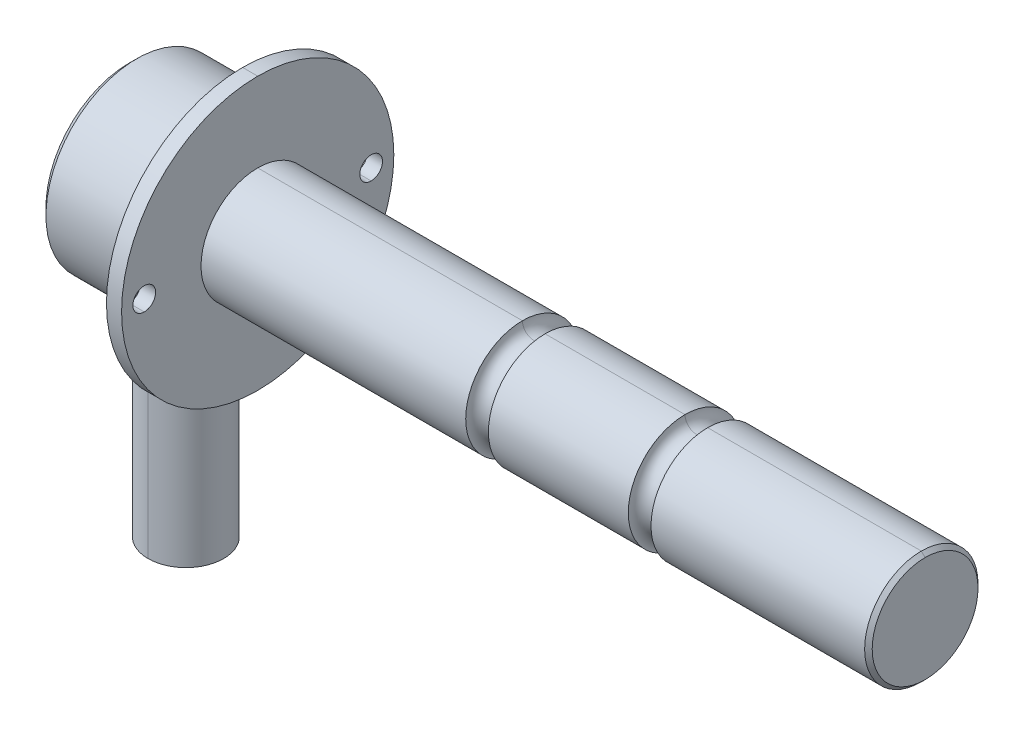
ISO-10303-21;
HEADER;
FILE_DESCRIPTION(('STEP AP214'),'2;1');
FILE_NAME('part.step','',(''),(''),'','','');
FILE_SCHEMA(('AUTOMOTIVE_DESIGN { 1 0 10303 214 1 1 1 1 }'));
ENDSEC;
DATA;
#1=APPLICATION_CONTEXT('core data for automotive mechanical design processes');
#2=APPLICATION_PROTOCOL_DEFINITION('international standard','automotive_design',2000,#1);
#3=PRODUCT_CONTEXT('',#1,'mechanical');
#4=PRODUCT('Part','Part','',(#3));
#5=PRODUCT_RELATED_PRODUCT_CATEGORY('part','',(#4));
#6=PRODUCT_DEFINITION_FORMATION('','',#4);
#7=PRODUCT_DEFINITION_CONTEXT('part definition',#1,'design');
#8=PRODUCT_DEFINITION('design','',#6,#7);
#9=PRODUCT_DEFINITION_SHAPE('','',#8);
#10=(LENGTH_UNIT() NAMED_UNIT(*) SI_UNIT(.MILLI.,.METRE.));
#11=(NAMED_UNIT(*) PLANE_ANGLE_UNIT() SI_UNIT($,.RADIAN.));
#12=(NAMED_UNIT(*) SI_UNIT($,.STERADIAN.) SOLID_ANGLE_UNIT());
#13=UNCERTAINTY_MEASURE_WITH_UNIT(LENGTH_MEASURE(1.E-05),#10,'distance_accuracy_value','');
#14=(GEOMETRIC_REPRESENTATION_CONTEXT(3) GLOBAL_UNCERTAINTY_ASSIGNED_CONTEXT((#13)) GLOBAL_UNIT_ASSIGNED_CONTEXT((#10,
#11,#12)) REPRESENTATION_CONTEXT('',''));
#15=CARTESIAN_POINT('',(0.,0.,0.));
#16=DIRECTION('',(0.,0.,1.));
#17=DIRECTION('',(1.,0.,0.));
#18=AXIS2_PLACEMENT_3D('',#15,#16,#17);
#19=CARTESIAN_POINT('',(0.,0.,0.));
#20=DIRECTION('',(1.,0.,0.));
#21=DIRECTION('',(0.,-1.,0.));
#22=AXIS2_PLACEMENT_3D('',#19,#20,#21);
#23=PLANE('',#22);
#24=CARTESIAN_POINT('',(0.,0.,30.));
#25=DIRECTION('',(1.,0.,0.));
#26=DIRECTION('',(0.,-1.,0.));
#27=AXIS2_PLACEMENT_3D('',#24,#25,#26);
#28=CIRCLE('',#27,3.);
#29=CARTESIAN_POINT('',(0.,-3.,30.));
#30=VERTEX_POINT('',#29);
#31=CARTESIAN_POINT('',(0.,3.,30.));
#32=VERTEX_POINT('',#31);
#33=EDGE_CURVE('E204',#30,#32,#28,.T.);
#34=ORIENTED_EDGE('',*,*,#33,.F.);
#35=CARTESIAN_POINT('',(0.,0.,30.));
#36=DIRECTION('',(1.,0.,0.));
#37=DIRECTION('',(0.,1.,0.));
#38=AXIS2_PLACEMENT_3D('',#35,#36,#37);
#39=CIRCLE('',#38,3.);
#40=EDGE_CURVE('E36',#32,#30,#39,.T.);
#41=ORIENTED_EDGE('',*,*,#40,.F.);
#42=EDGE_LOOP('',(#34,#41));
#43=FACE_BOUND('',#42,.T.);
#44=CARTESIAN_POINT('',(0.,0.,-30.));
#45=DIRECTION('',(1.,0.,0.));
#46=DIRECTION('',(0.,-1.,0.));
#47=AXIS2_PLACEMENT_3D('',#44,#45,#46);
#48=CIRCLE('',#47,3.);
#49=CARTESIAN_POINT('',(0.,-3.,-30.));
#50=VERTEX_POINT('',#49);
#51=CARTESIAN_POINT('',(0.,3.,-30.));
#52=VERTEX_POINT('',#51);
#53=EDGE_CURVE('E287',#50,#52,#48,.T.);
#54=ORIENTED_EDGE('',*,*,#53,.F.);
#55=CARTESIAN_POINT('',(0.,0.,-30.));
#56=DIRECTION('',(1.,0.,0.));
#57=DIRECTION('',(0.,1.,0.));
#58=AXIS2_PLACEMENT_3D('',#55,#56,#57);
#59=CIRCLE('',#58,3.);
#60=EDGE_CURVE('E195',#52,#50,#59,.T.);
#61=ORIENTED_EDGE('',*,*,#60,.F.);
#62=EDGE_LOOP('',(#54,#61));
#63=FACE_BOUND('',#62,.T.);
#64=CARTESIAN_POINT('',(0.,0.,0.));
#65=DIRECTION('',(1.,0.,0.));
#66=DIRECTION('',(0.,1.,0.));
#67=AXIS2_PLACEMENT_3D('',#64,#65,#66);
#68=CIRCLE('',#67,14.99);
#69=CARTESIAN_POINT('',(0.,14.99,0.));
#70=VERTEX_POINT('',#69);
#71=CARTESIAN_POINT('',(0.,-14.99,0.));
#72=VERTEX_POINT('',#71);
#73=EDGE_CURVE('E193',#70,#72,#68,.T.);
#74=ORIENTED_EDGE('',*,*,#73,.F.);
#75=CARTESIAN_POINT('',(0.,0.,0.));
#76=DIRECTION('',(-1.,0.,0.));
#77=DIRECTION('',(0.,1.,0.));
#78=AXIS2_PLACEMENT_3D('',#75,#76,#77);
#79=CIRCLE('',#78,14.99);
#80=EDGE_CURVE('E11',#70,#72,#79,.T.);
#81=ORIENTED_EDGE('',*,*,#80,.T.);
#82=EDGE_LOOP('',(#74,#81));
#83=FACE_BOUND('',#82,.T.);
#84=CARTESIAN_POINT('',(0.,0.,0.));
#85=DIRECTION('',(-1.,0.,0.));
#86=DIRECTION('',(0.,1.,0.));
#87=AXIS2_PLACEMENT_3D('',#84,#85,#86);
#88=CIRCLE('',#87,36.);
#89=CARTESIAN_POINT('',(0.,36.,0.));
#90=VERTEX_POINT('',#89);
#91=CARTESIAN_POINT('',(0.,-36.,0.));
#92=VERTEX_POINT('',#91);
#93=EDGE_CURVE('E191',#90,#92,#88,.T.);
#94=ORIENTED_EDGE('',*,*,#93,.F.);
#95=CARTESIAN_POINT('',(0.,0.,0.));
#96=DIRECTION('',(1.,0.,0.));
#97=DIRECTION('',(0.,1.,0.));
#98=AXIS2_PLACEMENT_3D('',#95,#96,#97);
#99=CIRCLE('',#98,36.);
#100=EDGE_CURVE('E27',#90,#92,#99,.T.);
#101=ORIENTED_EDGE('',*,*,#100,.T.);
#102=EDGE_LOOP('',(#94,#101));
#103=FACE_BOUND('',#102,.T.);
#104=ADVANCED_FACE('F16',(#43,#63,#83,#103),#23,.T.);
#105=CARTESIAN_POINT('',(-4.,0.,30.));
#106=DIRECTION('',(-1.,0.,0.));
#107=DIRECTION('',(0.,1.,0.));
#108=AXIS2_PLACEMENT_3D('',#105,#106,#107);
#109=CYLINDRICAL_SURFACE('',#108,3.);
#110=DIRECTION('',(1.,0.,0.));
#111=VECTOR('',#110,1.);
#112=CARTESIAN_POINT('',(-4.,3.,30.));
#113=LINE('',#112,#111);
#114=CARTESIAN_POINT('',(-4.,3.,30.));
#115=VERTEX_POINT('',#114);
#116=EDGE_CURVE('E201',#115,#32,#113,.T.);
#117=ORIENTED_EDGE('',*,*,#116,.F.);
#118=CARTESIAN_POINT('',(-4.,0.,30.));
#119=DIRECTION('',(1.,0.,0.));
#120=DIRECTION('',(0.,-1.,0.));
#121=AXIS2_PLACEMENT_3D('',#118,#119,#120);
#122=CIRCLE('',#121,3.);
#123=CARTESIAN_POINT('',(-4.,-3.,30.));
#124=VERTEX_POINT('',#123);
#125=EDGE_CURVE('E225',#124,#115,#122,.T.);
#126=ORIENTED_EDGE('',*,*,#125,.F.);
#127=DIRECTION('',(1.,0.,0.));
#128=VECTOR('',#127,1.);
#129=CARTESIAN_POINT('',(-4.,-3.,30.));
#130=LINE('',#129,#128);
#131=EDGE_CURVE('E246',#124,#30,#130,.T.);
#132=ORIENTED_EDGE('',*,*,#131,.T.);
#133=ORIENTED_EDGE('',*,*,#33,.T.);
#134=EDGE_LOOP('',(#117,#126,#132,#133));
#135=FACE_BOUND('',#134,.T.);
#136=ADVANCED_FACE('F553',(#135),#109,.F.);
#137=CARTESIAN_POINT('',(-4.,0.,30.));
#138=DIRECTION('',(-1.,0.,0.));
#139=DIRECTION('',(0.,1.,0.));
#140=AXIS2_PLACEMENT_3D('',#137,#138,#139);
#141=CYLINDRICAL_SURFACE('',#140,3.);
#142=ORIENTED_EDGE('',*,*,#131,.F.);
#143=CARTESIAN_POINT('',(-4.,0.,30.));
#144=DIRECTION('',(1.,0.,0.));
#145=DIRECTION('',(0.,1.,0.));
#146=AXIS2_PLACEMENT_3D('',#143,#144,#145);
#147=CIRCLE('',#146,3.);
#148=EDGE_CURVE('E221',#115,#124,#147,.T.);
#149=ORIENTED_EDGE('',*,*,#148,.F.);
#150=ORIENTED_EDGE('',*,*,#116,.T.);
#151=ORIENTED_EDGE('',*,*,#40,.T.);
#152=EDGE_LOOP('',(#142,#149,#150,#151));
#153=FACE_BOUND('',#152,.T.);
#154=ADVANCED_FACE('F544',(#153),#141,.F.);
#155=CARTESIAN_POINT('',(-4.,0.,-30.));
#156=DIRECTION('',(-1.,0.,0.));
#157=DIRECTION('',(0.,1.,0.));
#158=AXIS2_PLACEMENT_3D('',#155,#156,#157);
#159=CYLINDRICAL_SURFACE('',#158,3.);
#160=DIRECTION('',(1.,0.,0.));
#161=VECTOR('',#160,1.);
#162=CARTESIAN_POINT('',(-4.,3.,-30.));
#163=LINE('',#162,#161);
#164=CARTESIAN_POINT('',(-4.,3.,-30.));
#165=VERTEX_POINT('',#164);
#166=EDGE_CURVE('E291',#165,#52,#163,.T.);
#167=ORIENTED_EDGE('',*,*,#166,.F.);
#168=CARTESIAN_POINT('',(-4.,0.,-30.));
#169=DIRECTION('',(1.,0.,0.));
#170=DIRECTION('',(0.,-1.,0.));
#171=AXIS2_PLACEMENT_3D('',#168,#169,#170);
#172=CIRCLE('',#171,3.);
#173=CARTESIAN_POINT('',(-4.,-3.,-30.));
#174=VERTEX_POINT('',#173);
#175=EDGE_CURVE('E64',#174,#165,#172,.T.);
#176=ORIENTED_EDGE('',*,*,#175,.F.);
#177=DIRECTION('',(1.,0.,0.));
#178=VECTOR('',#177,1.);
#179=CARTESIAN_POINT('',(-4.,-3.,-30.));
#180=LINE('',#179,#178);
#181=EDGE_CURVE('E228',#174,#50,#180,.T.);
#182=ORIENTED_EDGE('',*,*,#181,.T.);
#183=ORIENTED_EDGE('',*,*,#53,.T.);
#184=EDGE_LOOP('',(#167,#176,#182,#183));
#185=FACE_BOUND('',#184,.T.);
#186=ADVANCED_FACE('F542',(#185),#159,.F.);
#187=CARTESIAN_POINT('',(-4.,0.,-30.));
#188=DIRECTION('',(-1.,0.,0.));
#189=DIRECTION('',(0.,1.,0.));
#190=AXIS2_PLACEMENT_3D('',#187,#188,#189);
#191=CYLINDRICAL_SURFACE('',#190,3.);
#192=ORIENTED_EDGE('',*,*,#181,.F.);
#193=CARTESIAN_POINT('',(-4.,0.,-30.));
#194=DIRECTION('',(1.,0.,0.));
#195=DIRECTION('',(0.,1.,0.));
#196=AXIS2_PLACEMENT_3D('',#193,#194,#195);
#197=CIRCLE('',#196,3.);
#198=EDGE_CURVE('E309',#165,#174,#197,.T.);
#199=ORIENTED_EDGE('',*,*,#198,.F.);
#200=ORIENTED_EDGE('',*,*,#166,.T.);
#201=ORIENTED_EDGE('',*,*,#60,.T.);
#202=EDGE_LOOP('',(#192,#199,#200,#201));
#203=FACE_BOUND('',#202,.T.);
#204=ADVANCED_FACE('F538',(#203),#191,.F.);
#205=CARTESIAN_POINT('',(-44.525,0.,0.));
#206=DIRECTION('',(-1.,0.,0.));
#207=DIRECTION('',(0.,-1.,0.));
#208=AXIS2_PLACEMENT_3D('',#205,#206,#207);
#209=CYLINDRICAL_SURFACE('',#208,14.99);
#210=ORIENTED_EDGE('',*,*,#73,.T.);
#211=DIRECTION('',(-1.,0.,0.));
#212=VECTOR('',#211,1.);
#213=CARTESIAN_POINT('',(70.,-14.99,0.));
#214=LINE('',#213,#212);
#215=CARTESIAN_POINT('',(70.,-14.99,0.));
#216=VERTEX_POINT('',#215);
#217=EDGE_CURVE('E296',#216,#72,#214,.T.);
#218=ORIENTED_EDGE('',*,*,#217,.F.);
#219=CARTESIAN_POINT('',(70.,0.,0.));
#220=DIRECTION('',(1.,0.,0.));
#221=DIRECTION('',(0.,1.,0.));
#222=AXIS2_PLACEMENT_3D('',#219,#220,#221);
#223=CIRCLE('',#222,14.99);
#224=CARTESIAN_POINT('',(70.,14.99,0.));
#225=VERTEX_POINT('',#224);
#226=EDGE_CURVE('E75',#225,#216,#223,.T.);
#227=ORIENTED_EDGE('',*,*,#226,.F.);
#228=DIRECTION('',(-1.,0.,0.));
#229=VECTOR('',#228,1.);
#230=CARTESIAN_POINT('',(70.,14.99,0.));
#231=LINE('',#230,#229);
#232=EDGE_CURVE('E196',#225,#70,#231,.T.);
#233=ORIENTED_EDGE('',*,*,#232,.T.);
#234=EDGE_LOOP('',(#210,#218,#227,#233));
#235=FACE_BOUND('',#234,.T.);
#236=ADVANCED_FACE('F551',(#235),#209,.T.);
#237=CARTESIAN_POINT('',(-44.525,0.,0.));
#238=DIRECTION('',(-1.,0.,0.));
#239=DIRECTION('',(0.,-1.,0.));
#240=AXIS2_PLACEMENT_3D('',#237,#238,#239);
#241=CYLINDRICAL_SURFACE('',#240,14.99);
#242=CARTESIAN_POINT('',(70.,0.,0.));
#243=DIRECTION('',(-1.,0.,0.));
#244=DIRECTION('',(0.,1.,0.));
#245=AXIS2_PLACEMENT_3D('',#242,#243,#244);
#246=CIRCLE('',#245,14.99);
#247=EDGE_CURVE('E276',#225,#216,#246,.T.);
#248=ORIENTED_EDGE('',*,*,#247,.T.);
#249=ORIENTED_EDGE('',*,*,#217,.T.);
#250=ORIENTED_EDGE('',*,*,#80,.F.);
#251=ORIENTED_EDGE('',*,*,#232,.F.);
#252=EDGE_LOOP('',(#248,#249,#250,#251));
#253=FACE_BOUND('',#252,.T.);
#254=ADVANCED_FACE('F566',(#253),#241,.T.);
#255=CARTESIAN_POINT('',(-44.525,0.,0.));
#256=DIRECTION('',(-1.,0.,0.));
#257=DIRECTION('',(0.,-1.,0.));
#258=AXIS2_PLACEMENT_3D('',#255,#256,#257);
#259=CYLINDRICAL_SURFACE('',#258,36.);
#260=ORIENTED_EDGE('',*,*,#93,.T.);
#261=DIRECTION('',(-1.,0.,0.));
#262=VECTOR('',#261,1.);
#263=CARTESIAN_POINT('',(0.,-36.,0.));
#264=LINE('',#263,#262);
#265=CARTESIAN_POINT('',(-4.,-36.,0.));
#266=VERTEX_POINT('',#265);
#267=EDGE_CURVE('E281',#92,#266,#264,.T.);
#268=ORIENTED_EDGE('',*,*,#267,.T.);
#269=CARTESIAN_POINT('',(-4.,0.,0.));
#270=DIRECTION('',(-1.,0.,0.));
#271=DIRECTION('',(0.,1.,0.));
#272=AXIS2_PLACEMENT_3D('',#269,#270,#271);
#273=CIRCLE('',#272,36.);
#274=CARTESIAN_POINT('',(-4.,36.,0.));
#275=VERTEX_POINT('',#274);
#276=EDGE_CURVE('E313',#275,#266,#273,.T.);
#277=ORIENTED_EDGE('',*,*,#276,.F.);
#278=DIRECTION('',(-1.,0.,0.));
#279=VECTOR('',#278,1.);
#280=CARTESIAN_POINT('',(0.,36.,0.));
#281=LINE('',#280,#279);
#282=EDGE_CURVE('E262',#90,#275,#281,.T.);
#283=ORIENTED_EDGE('',*,*,#282,.F.);
#284=EDGE_LOOP('',(#260,#268,#277,#283));
#285=FACE_BOUND('',#284,.T.);
#286=ADVANCED_FACE('F569',(#285),#259,.T.);
#287=CARTESIAN_POINT('',(-44.525,0.,0.));
#288=DIRECTION('',(-1.,0.,0.));
#289=DIRECTION('',(0.,-1.,0.));
#290=AXIS2_PLACEMENT_3D('',#287,#288,#289);
#291=CYLINDRICAL_SURFACE('',#290,36.);
#292=CARTESIAN_POINT('',(-4.,0.,0.));
#293=DIRECTION('',(1.,0.,0.));
#294=DIRECTION('',(0.,1.,0.));
#295=AXIS2_PLACEMENT_3D('',#292,#293,#294);
#296=CIRCLE('',#295,36.);
#297=EDGE_CURVE('E266',#275,#266,#296,.T.);
#298=ORIENTED_EDGE('',*,*,#297,.T.);
#299=ORIENTED_EDGE('',*,*,#267,.F.);
#300=ORIENTED_EDGE('',*,*,#100,.F.);
#301=ORIENTED_EDGE('',*,*,#282,.T.);
#302=EDGE_LOOP('',(#298,#299,#300,#301));
#303=FACE_BOUND('',#302,.T.);
#304=ADVANCED_FACE('F573',(#303),#291,.T.);
#305=CARTESIAN_POINT('',(-4.,0.,0.));
#306=DIRECTION('',(1.,0.,0.));
#307=DIRECTION('',(0.,-1.,0.));
#308=AXIS2_PLACEMENT_3D('',#305,#306,#307);
#309=PLANE('',#308);
#310=DIRECTION('',(0.,0.,-1.));
#311=VECTOR('',#310,1.);
#312=CARTESIAN_POINT('',(-4.,-21.,11.6189500386222));
#313=LINE('',#312,#311);
#314=CARTESIAN_POINT('',(-4.,-21.,11.6189500386222));
#315=VERTEX_POINT('',#314);
#316=CARTESIAN_POINT('',(-4.,-21.,-11.6189500386222));
#317=VERTEX_POINT('',#316);
#318=EDGE_CURVE('E267',#315,#317,#313,.T.);
#319=ORIENTED_EDGE('',*,*,#318,.T.);
#320=CARTESIAN_POINT('',(-4.,0.,0.));
#321=DIRECTION('',(1.,0.,0.));
#322=DIRECTION('',(0.,-0.875,-0.484122918275926));
#323=AXIS2_PLACEMENT_3D('',#320,#321,#322);
#324=CIRCLE('',#323,24.);
#325=EDGE_CURVE('E305',#317,#315,#324,.T.);
#326=ORIENTED_EDGE('',*,*,#325,.T.);
#327=EDGE_LOOP('',(#319,#326));
#328=FACE_BOUND('',#327,.T.);
#329=ORIENTED_EDGE('',*,*,#125,.T.);
#330=ORIENTED_EDGE('',*,*,#148,.T.);
#331=EDGE_LOOP('',(#329,#330));
#332=FACE_BOUND('',#331,.T.);
#333=ORIENTED_EDGE('',*,*,#175,.T.);
#334=ORIENTED_EDGE('',*,*,#198,.T.);
#335=EDGE_LOOP('',(#333,#334));
#336=FACE_BOUND('',#335,.T.);
#337=ORIENTED_EDGE('',*,*,#297,.F.);
#338=ORIENTED_EDGE('',*,*,#276,.T.);
#339=EDGE_LOOP('',(#337,#338));
#340=FACE_BOUND('',#339,.T.);
#341=ADVANCED_FACE('F644',(#328,#332,#336,#340),#309,.F.);
#342=CARTESIAN_POINT('',(73.,0.,0.));
#343=DIRECTION('',(1.,0.,0.));
#344=DIRECTION('',(0.,-1.,0.));
#345=AXIS2_PLACEMENT_3D('',#342,#343,#344);
#346=TOROIDAL_SURFACE('',#345,14.99,3.);
#347=ORIENTED_EDGE('',*,*,#226,.T.);
#348=CARTESIAN_POINT('',(73.,-14.99,0.));
#349=DIRECTION('',(0.,0.,1.));
#350=DIRECTION('',(1.,0.,0.));
#351=AXIS2_PLACEMENT_3D('',#348,#349,#350);
#352=CIRCLE('',#351,3.);
#353=CARTESIAN_POINT('',(76.,-14.99,0.));
#354=VERTEX_POINT('',#353);
#355=EDGE_CURVE('E325',#354,#216,#352,.T.);
#356=ORIENTED_EDGE('',*,*,#355,.F.);
#357=CARTESIAN_POINT('',(76.,0.,0.));
#358=DIRECTION('',(1.,0.,0.));
#359=DIRECTION('',(0.,1.,0.));
#360=AXIS2_PLACEMENT_3D('',#357,#358,#359);
#361=CIRCLE('',#360,14.99);
#362=CARTESIAN_POINT('',(76.,14.99,0.));
#363=VERTEX_POINT('',#362);
#364=EDGE_CURVE('E254',#363,#354,#361,.T.);
#365=ORIENTED_EDGE('',*,*,#364,.F.);
#366=CARTESIAN_POINT('',(73.,14.99,0.));
#367=DIRECTION('',(0.,0.,-1.));
#368=DIRECTION('',(1.,0.,0.));
#369=AXIS2_PLACEMENT_3D('',#366,#367,#368);
#370=CIRCLE('',#369,3.);
#371=EDGE_CURVE('E197',#363,#225,#370,.T.);
#372=ORIENTED_EDGE('',*,*,#371,.T.);
#373=EDGE_LOOP('',(#347,#356,#365,#372));
#374=FACE_BOUND('',#373,.T.);
#375=ADVANCED_FACE('F636',(#374),#346,.F.);
#376=CARTESIAN_POINT('',(73.,0.,0.));
#377=DIRECTION('',(1.,0.,0.));
#378=DIRECTION('',(0.,-1.,0.));
#379=AXIS2_PLACEMENT_3D('',#376,#377,#378);
#380=TOROIDAL_SURFACE('',#379,14.99,3.);
#381=CARTESIAN_POINT('',(76.,0.,0.));
#382=DIRECTION('',(-1.,0.,0.));
#383=DIRECTION('',(0.,1.,0.));
#384=AXIS2_PLACEMENT_3D('',#381,#382,#383);
#385=CIRCLE('',#384,14.99);
#386=EDGE_CURVE('E199',#363,#354,#385,.T.);
#387=ORIENTED_EDGE('',*,*,#386,.T.);
#388=ORIENTED_EDGE('',*,*,#355,.T.);
#389=ORIENTED_EDGE('',*,*,#247,.F.);
#390=ORIENTED_EDGE('',*,*,#371,.F.);
#391=EDGE_LOOP('',(#387,#388,#389,#390));
#392=FACE_BOUND('',#391,.T.);
#393=ADVANCED_FACE('F385',(#392),#380,.F.);
#394=CARTESIAN_POINT('',(-4.,-21.,11.6189500386222));
#395=DIRECTION('',(0.,1.,0.));
#396=DIRECTION('',(0.,0.,-1.));
#397=AXIS2_PLACEMENT_3D('',#394,#395,#396);
#398=PLANE('',#397);
#399=CARTESIAN_POINT('',(-19.,-21.,0.));
#400=DIRECTION('',(0.,-1.,0.));
#401=DIRECTION('',(0.,0.,-1.));
#402=AXIS2_PLACEMENT_3D('',#399,#400,#401);
#403=CIRCLE('',#402,10.);
#404=CARTESIAN_POINT('',(-19.,-21.,-10.));
#405=VERTEX_POINT('',#404);
#406=CARTESIAN_POINT('',(-19.,-21.,10.));
#407=VERTEX_POINT('',#406);
#408=EDGE_CURVE('E220',#405,#407,#403,.T.);
#409=ORIENTED_EDGE('',*,*,#408,.F.);
#410=CARTESIAN_POINT('',(-19.,-21.,0.));
#411=DIRECTION('',(0.,-1.,0.));
#412=DIRECTION('',(0.,0.,1.));
#413=AXIS2_PLACEMENT_3D('',#410,#411,#412);
#414=CIRCLE('',#413,10.);
#415=EDGE_CURVE('E250',#407,#405,#414,.T.);
#416=ORIENTED_EDGE('',*,*,#415,.F.);
#417=EDGE_LOOP('',(#409,#416));
#418=FACE_BOUND('',#417,.T.);
#419=CARTESIAN_POINT('',(-32.,-21.,11.6189500386222));
#420=CARTESIAN_POINT('',(-33.2460385873805,-21.,9.06267939634882));
#421=CARTESIAN_POINT('',(-34.,-21.,6.55743852430196));
#422=B_SPLINE_CURVE_WITH_KNOTS('',2,(#419,#420,#421),.UNSPECIFIED.,.F.,.F.,(3,3),(0.,1.),.UNSPECIFIED.);
#423=CARTESIAN_POINT('',(-32.,-21.,11.6189500386222));
#424=VERTEX_POINT('',#423);
#425=CARTESIAN_POINT('',(-34.,-21.,6.55743852430197));
#426=VERTEX_POINT('',#425);
#427=EDGE_CURVE('E329',#424,#426,#422,.T.);
#428=ORIENTED_EDGE('',*,*,#427,.T.);
#429=DIRECTION('',(0.,0.,-1.));
#430=VECTOR('',#429,1.);
#431=CARTESIAN_POINT('',(-34.,-21.,6.55743852430197));
#432=LINE('',#431,#430);
#433=CARTESIAN_POINT('',(-34.,-21.,-6.55743852430197));
#434=VERTEX_POINT('',#433);
#435=EDGE_CURVE('E444',#426,#434,#432,.T.);
#436=ORIENTED_EDGE('',*,*,#435,.T.);
#437=CARTESIAN_POINT('',(-34.,-21.,-6.55743852430198));
#438=CARTESIAN_POINT('',(-33.2460128034551,-21.,-9.06265773828478));
#439=CARTESIAN_POINT('',(-32.,-21.,-11.6189500386223));
#440=B_SPLINE_CURVE_WITH_KNOTS('',2,(#437,#438,#439),.UNSPECIFIED.,.F.,.F.,(3,3),(0.,1.),.UNSPECIFIED.);
#441=CARTESIAN_POINT('',(-32.,-21.,-11.6189500386222));
#442=VERTEX_POINT('',#441);
#443=EDGE_CURVE('E406',#434,#442,#440,.T.);
#444=ORIENTED_EDGE('',*,*,#443,.T.);
#445=DIRECTION('',(1.,0.,0.));
#446=VECTOR('',#445,1.);
#447=CARTESIAN_POINT('',(-32.,-21.,-11.6189500386222));
#448=LINE('',#447,#446);
#449=EDGE_CURVE('E410',#442,#317,#448,.T.);
#450=ORIENTED_EDGE('',*,*,#449,.T.);
#451=ORIENTED_EDGE('',*,*,#318,.F.);
#452=DIRECTION('',(1.,0.,0.));
#453=VECTOR('',#452,1.);
#454=CARTESIAN_POINT('',(-32.,-21.,11.6189500386222));
#455=LINE('',#454,#453);
#456=EDGE_CURVE('E429',#424,#315,#455,.T.);
#457=ORIENTED_EDGE('',*,*,#456,.F.);
#458=EDGE_LOOP('',(#428,#436,#444,#450,#451,#457));
#459=FACE_BOUND('',#458,.T.);
#460=ADVANCED_FACE('F374',(#418,#459),#398,.F.);
#461=CARTESIAN_POINT('',(-44.525,0.,0.));
#462=DIRECTION('',(-1.,0.,0.));
#463=DIRECTION('',(0.,-1.,0.));
#464=AXIS2_PLACEMENT_3D('',#461,#462,#463);
#465=CYLINDRICAL_SURFACE('',#464,24.);
#466=ORIENTED_EDGE('',*,*,#456,.T.);
#467=ORIENTED_EDGE('',*,*,#325,.F.);
#468=ORIENTED_EDGE('',*,*,#449,.F.);
#469=CARTESIAN_POINT('',(-32.,0.,0.));
#470=DIRECTION('',(1.,0.,0.));
#471=DIRECTION('',(0.,-0.875,-0.484122918275927));
#472=AXIS2_PLACEMENT_3D('',#469,#470,#471);
#473=CIRCLE('',#472,24.);
#474=EDGE_CURVE('E257',#442,#424,#473,.T.);
#475=ORIENTED_EDGE('',*,*,#474,.T.);
#476=EDGE_LOOP('',(#466,#467,#468,#475));
#477=FACE_BOUND('',#476,.T.);
#478=ADVANCED_FACE('F384',(#477),#465,.T.);
#479=CARTESIAN_POINT('',(-44.525,0.,0.));
#480=DIRECTION('',(-1.,0.,0.));
#481=DIRECTION('',(0.,-1.,0.));
#482=AXIS2_PLACEMENT_3D('',#479,#480,#481);
#483=CYLINDRICAL_SURFACE('',#482,14.99);
#484=ORIENTED_EDGE('',*,*,#364,.T.);
#485=DIRECTION('',(-1.,0.,0.));
#486=VECTOR('',#485,1.);
#487=CARTESIAN_POINT('',(113.,-14.99,0.));
#488=LINE('',#487,#486);
#489=CARTESIAN_POINT('',(113.,-14.99,0.));
#490=VERTEX_POINT('',#489);
#491=EDGE_CURVE('E205',#490,#354,#488,.T.);
#492=ORIENTED_EDGE('',*,*,#491,.F.);
#493=CARTESIAN_POINT('',(113.,0.,0.));
#494=DIRECTION('',(1.,0.,0.));
#495=DIRECTION('',(0.,1.,0.));
#496=AXIS2_PLACEMENT_3D('',#493,#494,#495);
#497=CIRCLE('',#496,14.99);
#498=CARTESIAN_POINT('',(113.,14.99,0.));
#499=VERTEX_POINT('',#498);
#500=EDGE_CURVE('E258',#499,#490,#497,.T.);
#501=ORIENTED_EDGE('',*,*,#500,.F.);
#502=DIRECTION('',(-1.,0.,0.));
#503=VECTOR('',#502,1.);
#504=CARTESIAN_POINT('',(113.,14.99,0.));
#505=LINE('',#504,#503);
#506=EDGE_CURVE('E232',#499,#363,#505,.T.);
#507=ORIENTED_EDGE('',*,*,#506,.T.);
#508=EDGE_LOOP('',(#484,#492,#501,#507));
#509=FACE_BOUND('',#508,.T.);
#510=ADVANCED_FACE('F575',(#509),#483,.T.);
#511=CARTESIAN_POINT('',(-44.525,0.,0.));
#512=DIRECTION('',(-1.,0.,0.));
#513=DIRECTION('',(0.,-1.,0.));
#514=AXIS2_PLACEMENT_3D('',#511,#512,#513);
#515=CYLINDRICAL_SURFACE('',#514,14.99);
#516=CARTESIAN_POINT('',(113.,0.,0.));
#517=DIRECTION('',(-1.,0.,0.));
#518=DIRECTION('',(0.,1.,0.));
#519=AXIS2_PLACEMENT_3D('',#516,#517,#518);
#520=CIRCLE('',#519,14.99);
#521=EDGE_CURVE('E209',#499,#490,#520,.T.);
#522=ORIENTED_EDGE('',*,*,#521,.T.);
#523=ORIENTED_EDGE('',*,*,#491,.T.);
#524=ORIENTED_EDGE('',*,*,#386,.F.);
#525=ORIENTED_EDGE('',*,*,#506,.F.);
#526=EDGE_LOOP('',(#522,#523,#524,#525));
#527=FACE_BOUND('',#526,.T.);
#528=ADVANCED_FACE('F577',(#527),#515,.T.);
#529=CARTESIAN_POINT('',(-19.,-21.,0.));
#530=DIRECTION('',(0.,1.,0.));
#531=DIRECTION('',(0.,0.,1.));
#532=AXIS2_PLACEMENT_3D('',#529,#530,#531);
#533=CYLINDRICAL_SURFACE('',#532,10.);
#534=DIRECTION('',(0.,-1.,0.));
#535=VECTOR('',#534,1.);
#536=CARTESIAN_POINT('',(-19.,-21.,10.));
#537=LINE('',#536,#535);
#538=CARTESIAN_POINT('',(-19.,-79.,10.));
#539=VERTEX_POINT('',#538);
#540=EDGE_CURVE('E210',#407,#539,#537,.T.);
#541=ORIENTED_EDGE('',*,*,#540,.T.);
#542=CARTESIAN_POINT('',(-19.,-79.,0.));
#543=DIRECTION('',(0.,-1.,0.));
#544=DIRECTION('',(0.,0.,-1.));
#545=AXIS2_PLACEMENT_3D('',#542,#543,#544);
#546=CIRCLE('',#545,10.);
#547=CARTESIAN_POINT('',(-19.,-79.,-10.));
#548=VERTEX_POINT('',#547);
#549=EDGE_CURVE('E233',#548,#539,#546,.T.);
#550=ORIENTED_EDGE('',*,*,#549,.F.);
#551=DIRECTION('',(0.,-1.,0.));
#552=VECTOR('',#551,1.);
#553=CARTESIAN_POINT('',(-19.,-21.,-10.));
#554=LINE('',#553,#552);
#555=EDGE_CURVE('E241',#405,#548,#554,.T.);
#556=ORIENTED_EDGE('',*,*,#555,.F.);
#557=ORIENTED_EDGE('',*,*,#408,.T.);
#558=EDGE_LOOP('',(#541,#550,#556,#557));
#559=FACE_BOUND('',#558,.T.);
#560=ADVANCED_FACE('F581',(#559),#533,.T.);
#561=CARTESIAN_POINT('',(-19.,-21.,0.));
#562=DIRECTION('',(0.,1.,0.));
#563=DIRECTION('',(0.,0.,1.));
#564=AXIS2_PLACEMENT_3D('',#561,#562,#563);
#565=CYLINDRICAL_SURFACE('',#564,10.);
#566=ORIENTED_EDGE('',*,*,#555,.T.);
#567=CARTESIAN_POINT('',(-19.,-79.,0.));
#568=DIRECTION('',(0.,-1.,0.));
#569=DIRECTION('',(0.,0.,1.));
#570=AXIS2_PLACEMENT_3D('',#567,#568,#569);
#571=CIRCLE('',#570,10.);
#572=EDGE_CURVE('E237',#539,#548,#571,.T.);
#573=ORIENTED_EDGE('',*,*,#572,.F.);
#574=ORIENTED_EDGE('',*,*,#540,.F.);
#575=ORIENTED_EDGE('',*,*,#415,.T.);
#576=EDGE_LOOP('',(#566,#573,#574,#575));
#577=FACE_BOUND('',#576,.T.);
#578=ADVANCED_FACE('F421',(#577),#565,.T.);
#579=CARTESIAN_POINT('',(-55.,0.,0.));
#580=DIRECTION('',(1.,0.,0.));
#581=DIRECTION('',(0.,0.,-1.));
#582=AXIS2_PLACEMENT_3D('',#579,#580,#581);
#583=CONICAL_SURFACE('',#582,1.,0.785398163397448);
#584=ORIENTED_EDGE('',*,*,#443,.F.);
#585=CARTESIAN_POINT('',(-34.,0.,0.));
#586=DIRECTION('',(-1.,0.,0.));
#587=DIRECTION('',(0.,-0.954545454545455,0.298065387468271));
#588=AXIS2_PLACEMENT_3D('',#585,#586,#587);
#589=CIRCLE('',#588,22.);
#590=EDGE_CURVE('E253',#426,#434,#589,.T.);
#591=ORIENTED_EDGE('',*,*,#590,.F.);
#592=ORIENTED_EDGE('',*,*,#427,.F.);
#593=ORIENTED_EDGE('',*,*,#474,.F.);
#594=EDGE_LOOP('',(#584,#591,#592,#593));
#595=FACE_BOUND('',#594,.T.);
#596=ADVANCED_FACE('F411',(#595),#583,.T.);
#597=CARTESIAN_POINT('',(-34.,0.,0.));
#598=DIRECTION('',(1.,0.,0.));
#599=DIRECTION('',(0.,-1.,0.));
#600=AXIS2_PLACEMENT_3D('',#597,#598,#599);
#601=PLANE('',#600);
#602=ORIENTED_EDGE('',*,*,#590,.T.);
#603=ORIENTED_EDGE('',*,*,#435,.F.);
#604=EDGE_LOOP('',(#602,#603));
#605=FACE_BOUND('',#604,.T.);
#606=ADVANCED_FACE('F388',(#605),#601,.F.);
#607=CARTESIAN_POINT('',(116.,0.,0.));
#608=DIRECTION('',(1.,0.,0.));
#609=DIRECTION('',(0.,-1.,0.));
#610=AXIS2_PLACEMENT_3D('',#607,#608,#609);
#611=TOROIDAL_SURFACE('',#610,14.99,3.);
#612=ORIENTED_EDGE('',*,*,#500,.T.);
#613=CARTESIAN_POINT('',(116.,-14.99,0.));
#614=DIRECTION('',(0.,0.,1.));
#615=DIRECTION('',(1.,0.,0.));
#616=AXIS2_PLACEMENT_3D('',#613,#614,#615);
#617=CIRCLE('',#616,3.);
#618=CARTESIAN_POINT('',(119.,-14.99,0.));
#619=VERTEX_POINT('',#618);
#620=EDGE_CURVE('E272',#619,#490,#617,.T.);
#621=ORIENTED_EDGE('',*,*,#620,.F.);
#622=CARTESIAN_POINT('',(119.,0.,0.));
#623=DIRECTION('',(1.,0.,0.));
#624=DIRECTION('',(0.,1.,0.));
#625=AXIS2_PLACEMENT_3D('',#622,#623,#624);
#626=CIRCLE('',#625,14.99);
#627=CARTESIAN_POINT('',(119.,14.99,0.));
#628=VERTEX_POINT('',#627);
#629=EDGE_CURVE('E211',#628,#619,#626,.T.);
#630=ORIENTED_EDGE('',*,*,#629,.F.);
#631=CARTESIAN_POINT('',(116.,14.99,0.));
#632=DIRECTION('',(0.,0.,-1.));
#633=DIRECTION('',(1.,0.,0.));
#634=AXIS2_PLACEMENT_3D('',#631,#632,#633);
#635=CIRCLE('',#634,3.);
#636=EDGE_CURVE('E261',#628,#499,#635,.T.);
#637=ORIENTED_EDGE('',*,*,#636,.T.);
#638=EDGE_LOOP('',(#612,#621,#630,#637));
#639=FACE_BOUND('',#638,.T.);
#640=ADVANCED_FACE('F423',(#639),#611,.F.);
#641=CARTESIAN_POINT('',(116.,0.,0.));
#642=DIRECTION('',(1.,0.,0.));
#643=DIRECTION('',(0.,-1.,0.));
#644=AXIS2_PLACEMENT_3D('',#641,#642,#643);
#645=TOROIDAL_SURFACE('',#644,14.99,3.);
#646=CARTESIAN_POINT('',(119.,0.,0.));
#647=DIRECTION('',(-1.,0.,0.));
#648=DIRECTION('',(0.,1.,0.));
#649=AXIS2_PLACEMENT_3D('',#646,#647,#648);
#650=CIRCLE('',#649,14.99);
#651=EDGE_CURVE('E268',#628,#619,#650,.T.);
#652=ORIENTED_EDGE('',*,*,#651,.T.);
#653=ORIENTED_EDGE('',*,*,#620,.T.);
#654=ORIENTED_EDGE('',*,*,#521,.F.);
#655=ORIENTED_EDGE('',*,*,#636,.F.);
#656=EDGE_LOOP('',(#652,#653,#654,#655));
#657=FACE_BOUND('',#656,.T.);
#658=ADVANCED_FACE('F588',(#657),#645,.F.);
#659=CARTESIAN_POINT('',(-4.,-79.,0.));
#660=DIRECTION('',(0.,-1.,0.));
#661=DIRECTION('',(0.,0.,1.));
#662=AXIS2_PLACEMENT_3D('',#659,#660,#661);
#663=PLANE('',#662);
#664=CARTESIAN_POINT('',(-19.,-79.,0.));
#665=DIRECTION('',(0.,1.,0.));
#666=DIRECTION('',(0.,0.,-1.));
#667=AXIS2_PLACEMENT_3D('',#664,#665,#666);
#668=CIRCLE('',#667,6.);
#669=CARTESIAN_POINT('',(-19.,-79.,-6.));
#670=VERTEX_POINT('',#669);
#671=CARTESIAN_POINT('',(-19.,-79.,6.));
#672=VERTEX_POINT('',#671);
#673=EDGE_CURVE('E292',#670,#672,#668,.T.);
#674=ORIENTED_EDGE('',*,*,#673,.T.);
#675=CARTESIAN_POINT('',(-19.,-79.,0.));
#676=DIRECTION('',(0.,1.,0.));
#677=DIRECTION('',(0.,0.,1.));
#678=AXIS2_PLACEMENT_3D('',#675,#676,#677);
#679=CIRCLE('',#678,6.);
#680=EDGE_CURVE('E236',#672,#670,#679,.T.);
#681=ORIENTED_EDGE('',*,*,#680,.T.);
#682=EDGE_LOOP('',(#674,#681));
#683=FACE_BOUND('',#682,.T.);
#684=ORIENTED_EDGE('',*,*,#549,.T.);
#685=ORIENTED_EDGE('',*,*,#572,.T.);
#686=EDGE_LOOP('',(#684,#685));
#687=FACE_BOUND('',#686,.T.);
#688=ADVANCED_FACE('F585',(#683,#687),#663,.T.);
#689=CARTESIAN_POINT('',(-44.525,0.,0.));
#690=DIRECTION('',(-1.,0.,0.));
#691=DIRECTION('',(0.,-1.,0.));
#692=AXIS2_PLACEMENT_3D('',#689,#690,#691);
#693=CYLINDRICAL_SURFACE('',#692,14.99);
#694=DIRECTION('',(-1.,0.,0.));
#695=VECTOR('',#694,1.);
#696=CARTESIAN_POINT('',(175.5,14.99,0.));
#697=LINE('',#696,#695);
#698=CARTESIAN_POINT('',(175.500000001803,14.9899999981964,1.1441317680309E-07));
#699=VERTEX_POINT('',#698);
#700=EDGE_CURVE('E215',#699,#628,#697,.T.);
#701=ORIENTED_EDGE('',*,*,#700,.T.);
#702=ORIENTED_EDGE('',*,*,#629,.T.);
#703=DIRECTION('',(-1.,0.,0.));
#704=VECTOR('',#703,1.);
#705=CARTESIAN_POINT('',(175.5,-14.99,0.));
#706=LINE('',#705,#704);
#707=CARTESIAN_POINT('',(175.500000001803,-14.9899999981964,-1.14413176888851E-07));
#708=VERTEX_POINT('',#707);
#709=EDGE_CURVE('E244',#708,#619,#706,.T.);
#710=ORIENTED_EDGE('',*,*,#709,.F.);
#711=CARTESIAN_POINT('',(175.5,0.,0.));
#712=DIRECTION('',(-1.,0.,0.));
#713=DIRECTION('',(0.,-1.,0.));
#714=AXIS2_PLACEMENT_3D('',#711,#712,#713);
#715=CIRCLE('',#714,14.99);
#716=EDGE_CURVE('E216',#708,#699,#715,.T.);
#717=ORIENTED_EDGE('',*,*,#716,.T.);
#718=EDGE_LOOP('',(#701,#702,#710,#717));
#719=FACE_BOUND('',#718,.T.);
#720=ADVANCED_FACE('F587',(#719),#693,.T.);
#721=CARTESIAN_POINT('',(-44.525,0.,0.));
#722=DIRECTION('',(-1.,0.,0.));
#723=DIRECTION('',(0.,-1.,0.));
#724=AXIS2_PLACEMENT_3D('',#721,#722,#723);
#725=CYLINDRICAL_SURFACE('',#724,14.99);
#726=ORIENTED_EDGE('',*,*,#709,.T.);
#727=ORIENTED_EDGE('',*,*,#651,.F.);
#728=ORIENTED_EDGE('',*,*,#700,.F.);
#729=CARTESIAN_POINT('',(175.5,0.,0.));
#730=DIRECTION('',(-1.,0.,0.));
#731=DIRECTION('',(0.,1.,0.));
#732=AXIS2_PLACEMENT_3D('',#729,#730,#731);
#733=CIRCLE('',#732,14.99);
#734=EDGE_CURVE('E167',#699,#708,#733,.T.);
#735=ORIENTED_EDGE('',*,*,#734,.T.);
#736=EDGE_LOOP('',(#726,#727,#728,#735));
#737=FACE_BOUND('',#736,.T.);
#738=ADVANCED_FACE('F565',(#737),#725,.T.);
#739=CARTESIAN_POINT('',(-19.,-21.,0.));
#740=DIRECTION('',(0.,1.,0.));
#741=DIRECTION('',(0.,0.,1.));
#742=AXIS2_PLACEMENT_3D('',#739,#740,#741);
#743=CYLINDRICAL_SURFACE('',#742,6.);
#744=DIRECTION('',(0.,-1.,0.));
#745=VECTOR('',#744,1.);
#746=CARTESIAN_POINT('',(-19.,-21.,6.));
#747=LINE('',#746,#745);
#748=CARTESIAN_POINT('',(-19.,-21.,6.));
#749=VERTEX_POINT('',#748);
#750=EDGE_CURVE('E245',#749,#672,#747,.T.);
#751=ORIENTED_EDGE('',*,*,#750,.T.);
#752=ORIENTED_EDGE('',*,*,#673,.F.);
#753=DIRECTION('',(0.,-1.,0.));
#754=VECTOR('',#753,1.);
#755=CARTESIAN_POINT('',(-19.,-21.,-6.));
#756=LINE('',#755,#754);
#757=CARTESIAN_POINT('',(-19.,-21.,-6.));
#758=VERTEX_POINT('',#757);
#759=EDGE_CURVE('E280',#758,#670,#756,.T.);
#760=ORIENTED_EDGE('',*,*,#759,.F.);
#761=CARTESIAN_POINT('',(-19.,-21.,0.));
#762=DIRECTION('',(0.,-1.,0.));
#763=DIRECTION('',(0.,0.,1.));
#764=AXIS2_PLACEMENT_3D('',#761,#762,#763);
#765=CIRCLE('',#764,6.);
#766=EDGE_CURVE('E179',#749,#758,#765,.T.);
#767=ORIENTED_EDGE('',*,*,#766,.F.);
#768=EDGE_LOOP('',(#751,#752,#760,#767));
#769=FACE_BOUND('',#768,.T.);
#770=ADVANCED_FACE('F854',(#769),#743,.F.);
#771=CARTESIAN_POINT('',(-19.,-21.,0.));
#772=DIRECTION('',(0.,1.,0.));
#773=DIRECTION('',(0.,0.,1.));
#774=AXIS2_PLACEMENT_3D('',#771,#772,#773);
#775=CYLINDRICAL_SURFACE('',#774,6.);
#776=ORIENTED_EDGE('',*,*,#759,.T.);
#777=ORIENTED_EDGE('',*,*,#680,.F.);
#778=ORIENTED_EDGE('',*,*,#750,.F.);
#779=CARTESIAN_POINT('',(-19.,-21.,0.));
#780=DIRECTION('',(0.,-1.,0.));
#781=DIRECTION('',(0.,0.,-1.));
#782=AXIS2_PLACEMENT_3D('',#779,#780,#781);
#783=CIRCLE('',#782,6.);
#784=EDGE_CURVE('E187',#758,#749,#783,.T.);
#785=ORIENTED_EDGE('',*,*,#784,.F.);
#786=EDGE_LOOP('',(#776,#777,#778,#785));
#787=FACE_BOUND('',#786,.T.);
#788=ADVANCED_FACE('F866',(#787),#775,.F.);
#789=CARTESIAN_POINT('',(189.49,0.,0.));
#790=DIRECTION('',(-1.,0.,0.));
#791=DIRECTION('',(0.,0.,-1.));
#792=AXIS2_PLACEMENT_3D('',#789,#790,#791);
#793=CONICAL_SURFACE('',#792,1.,0.785398163397448);
#794=DIRECTION('',(0.707106781186542,0.707106781186552,2.15883430321173E-08));
#795=VECTOR('',#794,1.);
#796=CARTESIAN_POINT('',(175.500000007215,-14.9899999927855,-4.57652700212421E-07));
#797=LINE('',#796,#795);
#798=CARTESIAN_POINT('',(176.500000002244,-13.9899999977556,-1.42374057573977E-07));
#799=VERTEX_POINT('',#798);
#800=EDGE_CURVE('E174',#708,#799,#797,.T.);
#801=ORIENTED_EDGE('',*,*,#800,.T.);
#802=CARTESIAN_POINT('',(176.5,0.,0.));
#803=DIRECTION('',(-1.,0.,0.));
#804=DIRECTION('',(0.,-1.,0.));
#805=AXIS2_PLACEMENT_3D('',#802,#803,#804);
#806=CIRCLE('',#805,13.99);
#807=CARTESIAN_POINT('',(176.500000002244,13.9899999977556,1.42374055967416E-07));
#808=VERTEX_POINT('',#807);
#809=EDGE_CURVE('E157',#799,#808,#806,.T.);
#810=ORIENTED_EDGE('',*,*,#809,.T.);
#811=DIRECTION('',(0.707106781186542,-0.707106781186552,-2.15883474956496E-08));
#812=VECTOR('',#811,1.);
#813=CARTESIAN_POINT('',(175.500000007215,14.9899999927855,4.57652701705125E-07));
#814=LINE('',#813,#812);
#815=EDGE_CURVE('E163',#699,#808,#814,.T.);
#816=ORIENTED_EDGE('',*,*,#815,.F.);
#817=ORIENTED_EDGE('',*,*,#716,.F.);
#818=EDGE_LOOP('',(#801,#810,#816,#817));
#819=FACE_BOUND('',#818,.T.);
#820=ADVANCED_FACE('F173',(#819),#793,.T.);
#821=CARTESIAN_POINT('',(189.49,0.,0.));
#822=DIRECTION('',(-1.,0.,0.));
#823=DIRECTION('',(0.,0.,-1.));
#824=AXIS2_PLACEMENT_3D('',#821,#822,#823);
#825=CONICAL_SURFACE('',#824,1.,0.785398163397448);
#826=ORIENTED_EDGE('',*,*,#815,.T.);
#827=CARTESIAN_POINT('',(176.5,0.,0.));
#828=DIRECTION('',(-1.,0.,0.));
#829=DIRECTION('',(0.,1.,0.));
#830=AXIS2_PLACEMENT_3D('',#827,#828,#829);
#831=CIRCLE('',#830,13.99);
#832=EDGE_CURVE('E166',#808,#799,#831,.T.);
#833=ORIENTED_EDGE('',*,*,#832,.T.);
#834=ORIENTED_EDGE('',*,*,#800,.F.);
#835=ORIENTED_EDGE('',*,*,#734,.F.);
#836=EDGE_LOOP('',(#826,#833,#834,#835));
#837=FACE_BOUND('',#836,.T.);
#838=ADVANCED_FACE('F164',(#837),#825,.T.);
#839=CARTESIAN_POINT('',(-4.,-21.,11.6189500386222));
#840=DIRECTION('',(0.,1.,0.));
#841=DIRECTION('',(0.,0.,-1.));
#842=AXIS2_PLACEMENT_3D('',#839,#840,#841);
#843=PLANE('',#842);
#844=ORIENTED_EDGE('',*,*,#766,.T.);
#845=ORIENTED_EDGE('',*,*,#784,.T.);
#846=EDGE_LOOP('',(#844,#845));
#847=FACE_BOUND('',#846,.T.);
#848=ADVANCED_FACE('F18',(#847),#843,.F.);
#849=CARTESIAN_POINT('',(176.5,0.,0.));
#850=DIRECTION('',(1.,0.,0.));
#851=DIRECTION('',(0.,-1.,0.));
#852=AXIS2_PLACEMENT_3D('',#849,#850,#851);
#853=PLANE('',#852);
#854=ORIENTED_EDGE('',*,*,#809,.F.);
#855=ORIENTED_EDGE('',*,*,#832,.F.);
#856=EDGE_LOOP('',(#854,#855));
#857=FACE_BOUND('',#856,.T.);
#858=ADVANCED_FACE('F177',(#857),#853,.T.);
#859=CLOSED_SHELL('',(#104,#136,#154,#186,#204,#236,#254,#286,#304,#341,#375,#393,#460,#478,
#510,#528,#560,#578,#596,#606,#640,#658,#688,#720,#738,#770,#788,#820,#838,#848,#858));
#860=MANIFOLD_SOLID_BREP('B1',#859);
#861=ADVANCED_BREP_SHAPE_REPRESENTATION('',(#18,#860),#14);
#862=SHAPE_DEFINITION_REPRESENTATION(#9,#861);
ENDSEC;
END-ISO-10303-21;
